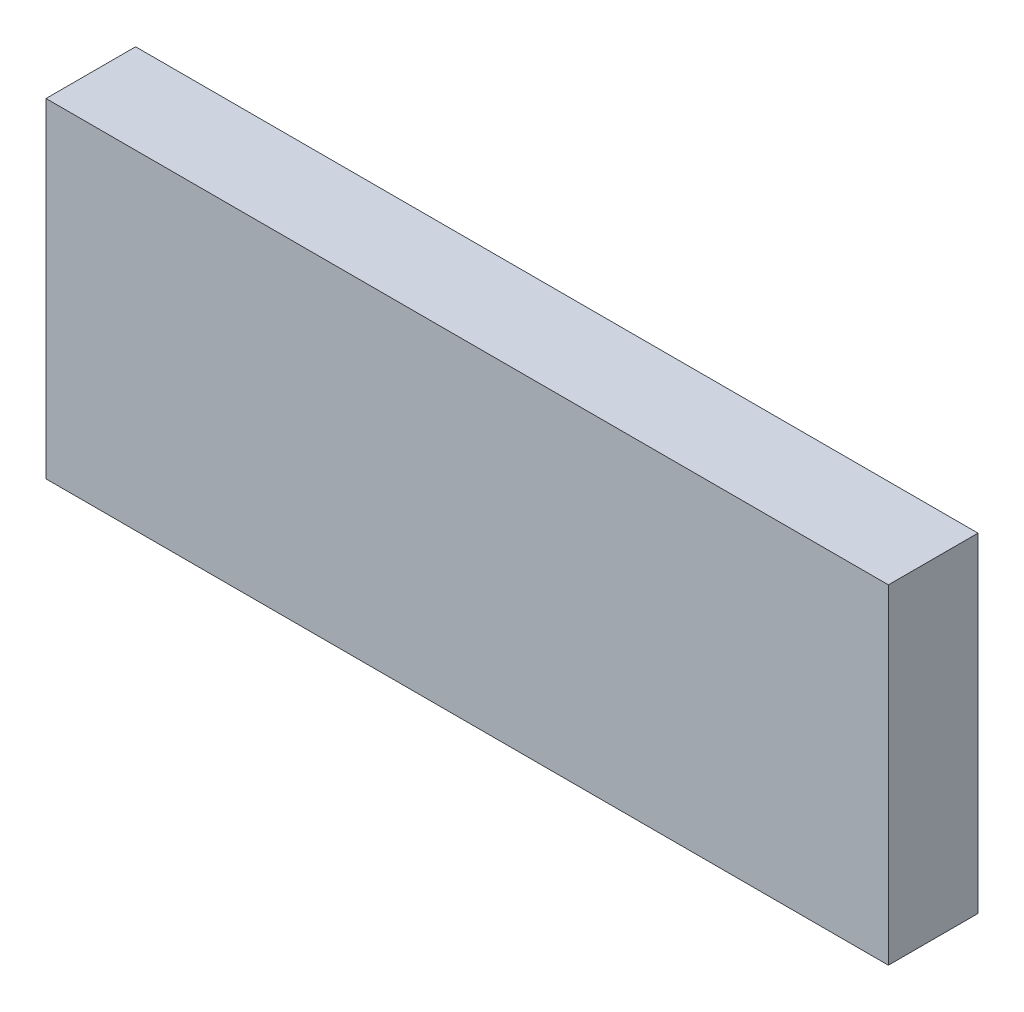
ISO-10303-21;
HEADER;
FILE_DESCRIPTION(('STEP AP214'),'2;1');
FILE_NAME('part.step','',(''),(''),'','','');
FILE_SCHEMA(('AUTOMOTIVE_DESIGN { 1 0 10303 214 1 1 1 1 }'));
ENDSEC;
DATA;
#1=APPLICATION_CONTEXT('core data for automotive mechanical design processes');
#2=APPLICATION_PROTOCOL_DEFINITION('international standard','automotive_design',2000,#1);
#3=PRODUCT_CONTEXT('',#1,'mechanical');
#4=PRODUCT('Part','Part','',(#3));
#5=PRODUCT_RELATED_PRODUCT_CATEGORY('part','',(#4));
#6=PRODUCT_DEFINITION_FORMATION('','',#4);
#7=PRODUCT_DEFINITION_CONTEXT('part definition',#1,'design');
#8=PRODUCT_DEFINITION('design','',#6,#7);
#9=PRODUCT_DEFINITION_SHAPE('','',#8);
#10=(LENGTH_UNIT() NAMED_UNIT(*) SI_UNIT(.MILLI.,.METRE.));
#11=(NAMED_UNIT(*) PLANE_ANGLE_UNIT() SI_UNIT($,.RADIAN.));
#12=(NAMED_UNIT(*) SI_UNIT($,.STERADIAN.) SOLID_ANGLE_UNIT());
#13=UNCERTAINTY_MEASURE_WITH_UNIT(LENGTH_MEASURE(1.E-05),#10,'distance_accuracy_value','');
#14=(GEOMETRIC_REPRESENTATION_CONTEXT(3) GLOBAL_UNCERTAINTY_ASSIGNED_CONTEXT((#13)) GLOBAL_UNIT_ASSIGNED_CONTEXT((#10,
#11,#12)) REPRESENTATION_CONTEXT('',''));
#15=CARTESIAN_POINT('',(0.,0.,0.));
#16=DIRECTION('',(0.,0.,1.));
#17=DIRECTION('',(1.,0.,0.));
#18=AXIS2_PLACEMENT_3D('',#15,#16,#17);
#19=CARTESIAN_POINT('',(1.59826706,-0.62500002,0.33999932));
#20=DIRECTION('',(0.,0.,1.));
#21=DIRECTION('',(1.,0.,0.));
#22=AXIS2_PLACEMENT_3D('',#19,#20,#21);
#23=PLANE('',#22);
#24=DIRECTION('',(0.,-1.,0.));
#25=VECTOR('',#24,1.);
#26=CARTESIAN_POINT('',(1.59826706,0.62500002,0.33999932));
#27=LINE('',#26,#25);
#28=CARTESIAN_POINT('',(1.59826706,0.62500002,0.33999932));
#29=VERTEX_POINT('',#28);
#30=CARTESIAN_POINT('',(1.59826706,-0.62500002,0.33999932));
#31=VERTEX_POINT('',#30);
#32=EDGE_CURVE('E27',#29,#31,#27,.T.);
#33=ORIENTED_EDGE('',*,*,#32,.F.);
#34=DIRECTION('',(1.,0.,0.));
#35=VECTOR('',#34,1.);
#36=CARTESIAN_POINT('',(-1.59826452,0.62500002,0.33999932));
#37=LINE('',#36,#35);
#38=CARTESIAN_POINT('',(-1.59826452,0.62500002,0.33999932));
#39=VERTEX_POINT('',#38);
#40=EDGE_CURVE('E106',#39,#29,#37,.T.);
#41=ORIENTED_EDGE('',*,*,#40,.F.);
#42=DIRECTION('',(0.,1.,0.));
#43=VECTOR('',#42,1.);
#44=CARTESIAN_POINT('',(-1.59826452,-0.62500002,0.33999932));
#45=LINE('',#44,#43);
#46=CARTESIAN_POINT('',(-1.59826452,-0.62500002,0.33999932));
#47=VERTEX_POINT('',#46);
#48=EDGE_CURVE('E69',#47,#39,#45,.T.);
#49=ORIENTED_EDGE('',*,*,#48,.F.);
#50=DIRECTION('',(-1.,0.,0.));
#51=VECTOR('',#50,1.);
#52=CARTESIAN_POINT('',(1.59826706,-0.62500002,0.33999932));
#53=LINE('',#52,#51);
#54=EDGE_CURVE('E93',#31,#47,#53,.T.);
#55=ORIENTED_EDGE('',*,*,#54,.F.);
#56=EDGE_LOOP('',(#33,#41,#49,#55));
#57=FACE_BOUND('',#56,.T.);
#58=ADVANCED_FACE('F17',(#57),#23,.T.);
#59=CARTESIAN_POINT('',(1.59826706,-0.62500002,0.));
#60=DIRECTION('',(0.,0.,1.));
#61=DIRECTION('',(1.,0.,0.));
#62=AXIS2_PLACEMENT_3D('',#59,#60,#61);
#63=PLANE('',#62);
#64=DIRECTION('',(-1.,0.,0.));
#65=VECTOR('',#64,1.);
#66=CARTESIAN_POINT('',(1.59826706,-0.62500002,0.));
#67=LINE('',#66,#65);
#68=CARTESIAN_POINT('',(1.59826706,-0.62500002,0.));
#69=VERTEX_POINT('',#68);
#70=CARTESIAN_POINT('',(-1.59826452,-0.62500002,0.));
#71=VERTEX_POINT('',#70);
#72=EDGE_CURVE('E78',#69,#71,#67,.T.);
#73=ORIENTED_EDGE('',*,*,#72,.T.);
#74=DIRECTION('',(0.,1.,0.));
#75=VECTOR('',#74,1.);
#76=CARTESIAN_POINT('',(-1.59826452,-0.62500002,0.));
#77=LINE('',#76,#75);
#78=CARTESIAN_POINT('',(-1.59826452,0.62500002,0.));
#79=VERTEX_POINT('',#78);
#80=EDGE_CURVE('E55',#71,#79,#77,.T.);
#81=ORIENTED_EDGE('',*,*,#80,.T.);
#82=DIRECTION('',(1.,0.,0.));
#83=VECTOR('',#82,1.);
#84=CARTESIAN_POINT('',(-1.59826452,0.62500002,0.));
#85=LINE('',#84,#83);
#86=CARTESIAN_POINT('',(1.59826706,0.62500002,0.));
#87=VERTEX_POINT('',#86);
#88=EDGE_CURVE('E81',#79,#87,#85,.T.);
#89=ORIENTED_EDGE('',*,*,#88,.T.);
#90=DIRECTION('',(0.,-1.,0.));
#91=VECTOR('',#90,1.);
#92=CARTESIAN_POINT('',(1.59826706,0.62500002,0.));
#93=LINE('',#92,#91);
#94=EDGE_CURVE('E11',#87,#69,#93,.T.);
#95=ORIENTED_EDGE('',*,*,#94,.T.);
#96=EDGE_LOOP('',(#73,#81,#89,#95));
#97=FACE_BOUND('',#96,.T.);
#98=ADVANCED_FACE('F77',(#97),#63,.F.);
#99=CARTESIAN_POINT('',(1.59826706,0.62500002,0.));
#100=DIRECTION('',(1.,0.,0.));
#101=DIRECTION('',(0.,1.,0.));
#102=AXIS2_PLACEMENT_3D('',#99,#100,#101);
#103=PLANE('',#102);
#104=DIRECTION('',(0.,0.,1.));
#105=VECTOR('',#104,1.);
#106=CARTESIAN_POINT('',(1.59826706,0.62500002,0.));
#107=LINE('',#106,#105);
#108=EDGE_CURVE('E102',#87,#29,#107,.T.);
#109=ORIENTED_EDGE('',*,*,#108,.T.);
#110=ORIENTED_EDGE('',*,*,#32,.T.);
#111=DIRECTION('',(0.,0.,1.));
#112=VECTOR('',#111,1.);
#113=CARTESIAN_POINT('',(1.59826706,-0.62500002,0.));
#114=LINE('',#113,#112);
#115=EDGE_CURVE('E87',#69,#31,#114,.T.);
#116=ORIENTED_EDGE('',*,*,#115,.F.);
#117=ORIENTED_EDGE('',*,*,#94,.F.);
#118=EDGE_LOOP('',(#109,#110,#116,#117));
#119=FACE_BOUND('',#118,.T.);
#120=ADVANCED_FACE('F91',(#119),#103,.T.);
#121=CARTESIAN_POINT('',(-1.59826452,0.62500002,0.));
#122=DIRECTION('',(0.,1.,0.));
#123=DIRECTION('',(1.,0.,0.));
#124=AXIS2_PLACEMENT_3D('',#121,#122,#123);
#125=PLANE('',#124);
#126=DIRECTION('',(0.,0.,1.));
#127=VECTOR('',#126,1.);
#128=CARTESIAN_POINT('',(-1.59826452,0.62500002,0.));
#129=LINE('',#128,#127);
#130=EDGE_CURVE('E105',#79,#39,#129,.T.);
#131=ORIENTED_EDGE('',*,*,#130,.T.);
#132=ORIENTED_EDGE('',*,*,#40,.T.);
#133=ORIENTED_EDGE('',*,*,#108,.F.);
#134=ORIENTED_EDGE('',*,*,#88,.F.);
#135=EDGE_LOOP('',(#131,#132,#133,#134));
#136=FACE_BOUND('',#135,.T.);
#137=ADVANCED_FACE('F123',(#136),#125,.T.);
#138=CARTESIAN_POINT('',(-1.59826452,-0.62500002,0.));
#139=DIRECTION('',(-1.,0.,0.));
#140=DIRECTION('',(0.,0.,1.));
#141=AXIS2_PLACEMENT_3D('',#138,#139,#140);
#142=PLANE('',#141);
#143=DIRECTION('',(0.,0.,1.));
#144=VECTOR('',#143,1.);
#145=CARTESIAN_POINT('',(-1.59826452,-0.62500002,0.));
#146=LINE('',#145,#144);
#147=EDGE_CURVE('E88',#71,#47,#146,.T.);
#148=ORIENTED_EDGE('',*,*,#147,.T.);
#149=ORIENTED_EDGE('',*,*,#48,.T.);
#150=ORIENTED_EDGE('',*,*,#130,.F.);
#151=ORIENTED_EDGE('',*,*,#80,.F.);
#152=EDGE_LOOP('',(#148,#149,#150,#151));
#153=FACE_BOUND('',#152,.T.);
#154=ADVANCED_FACE('F19',(#153),#142,.T.);
#155=CARTESIAN_POINT('',(1.59826706,-0.62500002,0.));
#156=DIRECTION('',(0.,-1.,0.));
#157=DIRECTION('',(0.,0.,-1.));
#158=AXIS2_PLACEMENT_3D('',#155,#156,#157);
#159=PLANE('',#158);
#160=ORIENTED_EDGE('',*,*,#115,.T.);
#161=ORIENTED_EDGE('',*,*,#54,.T.);
#162=ORIENTED_EDGE('',*,*,#147,.F.);
#163=ORIENTED_EDGE('',*,*,#72,.F.);
#164=EDGE_LOOP('',(#160,#161,#162,#163));
#165=FACE_BOUND('',#164,.T.);
#166=ADVANCED_FACE('F85',(#165),#159,.T.);
#167=CLOSED_SHELL('',(#58,#98,#120,#137,#154,#166));
#168=MANIFOLD_SOLID_BREP('B1',#167);
#169=ADVANCED_BREP_SHAPE_REPRESENTATION('',(#18,#168),#14);
#170=SHAPE_DEFINITION_REPRESENTATION(#9,#169);
ENDSEC;
END-ISO-10303-21;
